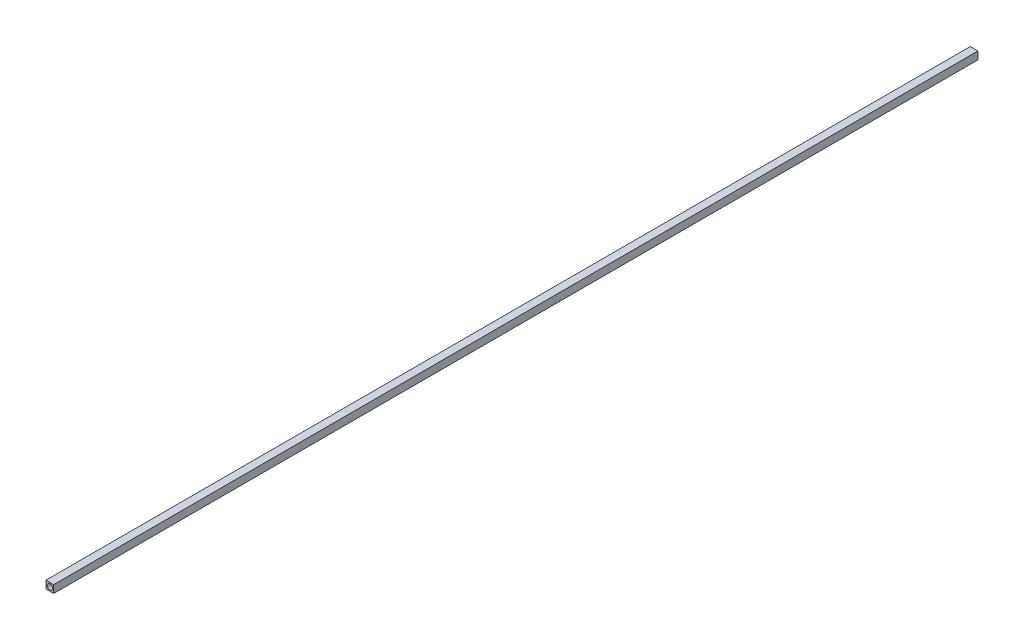
ISO-10303-21;
HEADER;
FILE_DESCRIPTION(('STEP AP214'),'2;1');
FILE_NAME('part.step','',(''),(''),'','','');
FILE_SCHEMA(('AUTOMOTIVE_DESIGN { 1 0 10303 214 1 1 1 1 }'));
ENDSEC;
DATA;
#1=APPLICATION_CONTEXT('core data for automotive mechanical design processes');
#2=APPLICATION_PROTOCOL_DEFINITION('international standard','automotive_design',2000,#1);
#3=PRODUCT_CONTEXT('',#1,'mechanical');
#4=PRODUCT('Part','Part','',(#3));
#5=PRODUCT_RELATED_PRODUCT_CATEGORY('part','',(#4));
#6=PRODUCT_DEFINITION_FORMATION('','',#4);
#7=PRODUCT_DEFINITION_CONTEXT('part definition',#1,'design');
#8=PRODUCT_DEFINITION('design','',#6,#7);
#9=PRODUCT_DEFINITION_SHAPE('','',#8);
#10=(LENGTH_UNIT() NAMED_UNIT(*) SI_UNIT(.MILLI.,.METRE.));
#11=(NAMED_UNIT(*) PLANE_ANGLE_UNIT() SI_UNIT($,.RADIAN.));
#12=(NAMED_UNIT(*) SI_UNIT($,.STERADIAN.) SOLID_ANGLE_UNIT());
#13=UNCERTAINTY_MEASURE_WITH_UNIT(LENGTH_MEASURE(1.E-05),#10,'distance_accuracy_value','');
#14=(GEOMETRIC_REPRESENTATION_CONTEXT(3) GLOBAL_UNCERTAINTY_ASSIGNED_CONTEXT((#13)) GLOBAL_UNIT_ASSIGNED_CONTEXT((#10,
#11,#12)) REPRESENTATION_CONTEXT('',''));
#15=CARTESIAN_POINT('',(0.,0.,0.));
#16=DIRECTION('',(0.,0.,1.));
#17=DIRECTION('',(1.,0.,0.));
#18=AXIS2_PLACEMENT_3D('',#15,#16,#17);
#19=CARTESIAN_POINT('',(0.,0.,762.));
#20=DIRECTION('',(0.,0.,1.));
#21=DIRECTION('',(1.,0.,0.));
#22=AXIS2_PLACEMENT_3D('',#19,#20,#21);
#23=PLANE('',#22);
#24=DIRECTION('',(0.,-1.,0.));
#25=VECTOR('',#24,1.);
#26=CARTESIAN_POINT('',(-3.175,-3.175,762.));
#27=LINE('',#26,#25);
#28=CARTESIAN_POINT('',(-3.175,3.175,762.));
#29=VERTEX_POINT('',#28);
#30=CARTESIAN_POINT('',(-3.175,-3.175,762.));
#31=VERTEX_POINT('',#30);
#32=EDGE_CURVE('E90',#29,#31,#27,.T.);
#33=ORIENTED_EDGE('',*,*,#32,.T.);
#34=DIRECTION('',(1.,0.,0.));
#35=VECTOR('',#34,1.);
#36=CARTESIAN_POINT('',(3.175,-3.175,762.));
#37=LINE('',#36,#35);
#38=CARTESIAN_POINT('',(3.175,-3.175,762.));
#39=VERTEX_POINT('',#38);
#40=EDGE_CURVE('E85',#31,#39,#37,.T.);
#41=ORIENTED_EDGE('',*,*,#40,.T.);
#42=DIRECTION('',(0.,1.,0.));
#43=VECTOR('',#42,1.);
#44=CARTESIAN_POINT('',(3.175,-3.175,762.));
#45=LINE('',#44,#43);
#46=CARTESIAN_POINT('',(3.175,3.175,762.));
#47=VERTEX_POINT('',#46);
#48=EDGE_CURVE('E88',#39,#47,#45,.T.);
#49=ORIENTED_EDGE('',*,*,#48,.T.);
#50=DIRECTION('',(-1.,0.,0.));
#51=VECTOR('',#50,1.);
#52=CARTESIAN_POINT('',(3.175,3.175,762.));
#53=LINE('',#52,#51);
#54=EDGE_CURVE('E55',#47,#29,#53,.T.);
#55=ORIENTED_EDGE('',*,*,#54,.T.);
#56=EDGE_LOOP('',(#33,#41,#49,#55));
#57=FACE_BOUND('',#56,.T.);
#58=CARTESIAN_POINT('',(0.,0.,762.));
#59=DIRECTION('',(0.,0.,1.));
#60=DIRECTION('',(1.,0.,0.));
#61=AXIS2_PLACEMENT_3D('',#58,#59,#60);
#62=CIRCLE('',#61,2.1844);
#63=CARTESIAN_POINT('',(2.1844,0.,762.));
#64=VERTEX_POINT('',#63);
#65=EDGE_CURVE('E105',#64,#64,#62,.T.);
#66=ORIENTED_EDGE('',*,*,#65,.F.);
#67=EDGE_LOOP('',(#66));
#68=FACE_BOUND('',#67,.T.);
#69=ADVANCED_FACE('F38',(#57,#68),#23,.T.);
#70=CARTESIAN_POINT('',(0.,0.,0.));
#71=DIRECTION('',(0.,0.,1.));
#72=DIRECTION('',(1.,0.,0.));
#73=AXIS2_PLACEMENT_3D('',#70,#71,#72);
#74=PLANE('',#73);
#75=DIRECTION('',(0.,-1.,0.));
#76=VECTOR('',#75,1.);
#77=CARTESIAN_POINT('',(-3.175,-3.175,0.));
#78=LINE('',#77,#76);
#79=CARTESIAN_POINT('',(-3.175,3.175,0.));
#80=VERTEX_POINT('',#79);
#81=CARTESIAN_POINT('',(-3.175,-3.175,0.));
#82=VERTEX_POINT('',#81);
#83=EDGE_CURVE('E102',#80,#82,#78,.T.);
#84=ORIENTED_EDGE('',*,*,#83,.F.);
#85=DIRECTION('',(-1.,0.,0.));
#86=VECTOR('',#85,1.);
#87=CARTESIAN_POINT('',(3.175,3.175,0.));
#88=LINE('',#87,#86);
#89=CARTESIAN_POINT('',(3.175,3.175,0.));
#90=VERTEX_POINT('',#89);
#91=EDGE_CURVE('E78',#90,#80,#88,.T.);
#92=ORIENTED_EDGE('',*,*,#91,.F.);
#93=DIRECTION('',(0.,1.,0.));
#94=VECTOR('',#93,1.);
#95=CARTESIAN_POINT('',(3.175,-3.175,0.));
#96=LINE('',#95,#94);
#97=CARTESIAN_POINT('',(3.175,-3.175,0.));
#98=VERTEX_POINT('',#97);
#99=EDGE_CURVE('E72',#98,#90,#96,.T.);
#100=ORIENTED_EDGE('',*,*,#99,.F.);
#101=DIRECTION('',(1.,0.,0.));
#102=VECTOR('',#101,1.);
#103=CARTESIAN_POINT('',(3.175,-3.175,0.));
#104=LINE('',#103,#102);
#105=EDGE_CURVE('E94',#82,#98,#104,.T.);
#106=ORIENTED_EDGE('',*,*,#105,.F.);
#107=EDGE_LOOP('',(#84,#92,#100,#106));
#108=FACE_BOUND('',#107,.T.);
#109=CARTESIAN_POINT('',(0.,0.,0.));
#110=DIRECTION('',(0.,0.,1.));
#111=DIRECTION('',(1.,0.,0.));
#112=AXIS2_PLACEMENT_3D('',#109,#110,#111);
#113=CIRCLE('',#112,2.1844);
#114=CARTESIAN_POINT('',(2.1844,0.,0.));
#115=VERTEX_POINT('',#114);
#116=EDGE_CURVE('E117',#115,#115,#113,.T.);
#117=ORIENTED_EDGE('',*,*,#116,.T.);
#118=EDGE_LOOP('',(#117));
#119=FACE_BOUND('',#118,.T.);
#120=ADVANCED_FACE('F113',(#108,#119),#74,.F.);
#121=CARTESIAN_POINT('',(-3.175,-3.175,762.));
#122=DIRECTION('',(1.,0.,0.));
#123=DIRECTION('',(0.,0.,-1.));
#124=AXIS2_PLACEMENT_3D('',#121,#122,#123);
#125=PLANE('',#124);
#126=ORIENTED_EDGE('',*,*,#83,.T.);
#127=DIRECTION('',(0.,0.,-1.));
#128=VECTOR('',#127,1.);
#129=CARTESIAN_POINT('',(-3.175,-3.175,762.));
#130=LINE('',#129,#128);
#131=EDGE_CURVE('E11',#31,#82,#130,.T.);
#132=ORIENTED_EDGE('',*,*,#131,.F.);
#133=ORIENTED_EDGE('',*,*,#32,.F.);
#134=DIRECTION('',(0.,0.,-1.));
#135=VECTOR('',#134,1.);
#136=CARTESIAN_POINT('',(-3.175,3.175,762.));
#137=LINE('',#136,#135);
#138=EDGE_CURVE('E98',#29,#80,#137,.T.);
#139=ORIENTED_EDGE('',*,*,#138,.T.);
#140=EDGE_LOOP('',(#126,#132,#133,#139));
#141=FACE_BOUND('',#140,.T.);
#142=ADVANCED_FACE('F40',(#141),#125,.F.);
#143=CARTESIAN_POINT('',(3.175,-3.175,762.));
#144=DIRECTION('',(0.,1.,0.));
#145=DIRECTION('',(-1.,0.,0.));
#146=AXIS2_PLACEMENT_3D('',#143,#144,#145);
#147=PLANE('',#146);
#148=ORIENTED_EDGE('',*,*,#105,.T.);
#149=DIRECTION('',(0.,0.,-1.));
#150=VECTOR('',#149,1.);
#151=CARTESIAN_POINT('',(3.175,-3.175,762.));
#152=LINE('',#151,#150);
#153=EDGE_CURVE('E47',#39,#98,#152,.T.);
#154=ORIENTED_EDGE('',*,*,#153,.F.);
#155=ORIENTED_EDGE('',*,*,#40,.F.);
#156=ORIENTED_EDGE('',*,*,#131,.T.);
#157=EDGE_LOOP('',(#148,#154,#155,#156));
#158=FACE_BOUND('',#157,.T.);
#159=ADVANCED_FACE('F93',(#158),#147,.F.);
#160=CARTESIAN_POINT('',(3.175,-3.175,762.));
#161=DIRECTION('',(-1.,0.,0.));
#162=DIRECTION('',(0.,0.,1.));
#163=AXIS2_PLACEMENT_3D('',#160,#161,#162);
#164=PLANE('',#163);
#165=ORIENTED_EDGE('',*,*,#99,.T.);
#166=DIRECTION('',(0.,0.,-1.));
#167=VECTOR('',#166,1.);
#168=CARTESIAN_POINT('',(3.175,3.175,762.));
#169=LINE('',#168,#167);
#170=EDGE_CURVE('E95',#47,#90,#169,.T.);
#171=ORIENTED_EDGE('',*,*,#170,.F.);
#172=ORIENTED_EDGE('',*,*,#48,.F.);
#173=ORIENTED_EDGE('',*,*,#153,.T.);
#174=EDGE_LOOP('',(#165,#171,#172,#173));
#175=FACE_BOUND('',#174,.T.);
#176=ADVANCED_FACE('F96',(#175),#164,.F.);
#177=CARTESIAN_POINT('',(3.175,3.175,762.));
#178=DIRECTION('',(0.,-1.,0.));
#179=DIRECTION('',(1.,0.,0.));
#180=AXIS2_PLACEMENT_3D('',#177,#178,#179);
#181=PLANE('',#180);
#182=ORIENTED_EDGE('',*,*,#91,.T.);
#183=ORIENTED_EDGE('',*,*,#138,.F.);
#184=ORIENTED_EDGE('',*,*,#54,.F.);
#185=ORIENTED_EDGE('',*,*,#170,.T.);
#186=EDGE_LOOP('',(#182,#183,#184,#185));
#187=FACE_BOUND('',#186,.T.);
#188=ADVANCED_FACE('F110',(#187),#181,.F.);
#189=CARTESIAN_POINT('',(0.,0.,762.));
#190=DIRECTION('',(0.,0.,-1.));
#191=DIRECTION('',(-1.,0.,0.));
#192=AXIS2_PLACEMENT_3D('',#189,#190,#191);
#193=CYLINDRICAL_SURFACE('',#192,2.1844);
#194=ORIENTED_EDGE('',*,*,#65,.T.);
#195=EDGE_LOOP('',(#194));
#196=FACE_BOUND('',#195,.T.);
#197=ORIENTED_EDGE('',*,*,#116,.F.);
#198=EDGE_LOOP('',(#197));
#199=FACE_BOUND('',#198,.T.);
#200=ADVANCED_FACE('F123',(#196,#199),#193,.F.);
#201=CLOSED_SHELL('',(#69,#120,#142,#159,#176,#188,#200));
#202=MANIFOLD_SOLID_BREP('B2',#201);
#203=ADVANCED_BREP_SHAPE_REPRESENTATION('',(#18,#202),#14);
#204=SHAPE_DEFINITION_REPRESENTATION(#9,#203);
ENDSEC;
END-ISO-10303-21;
